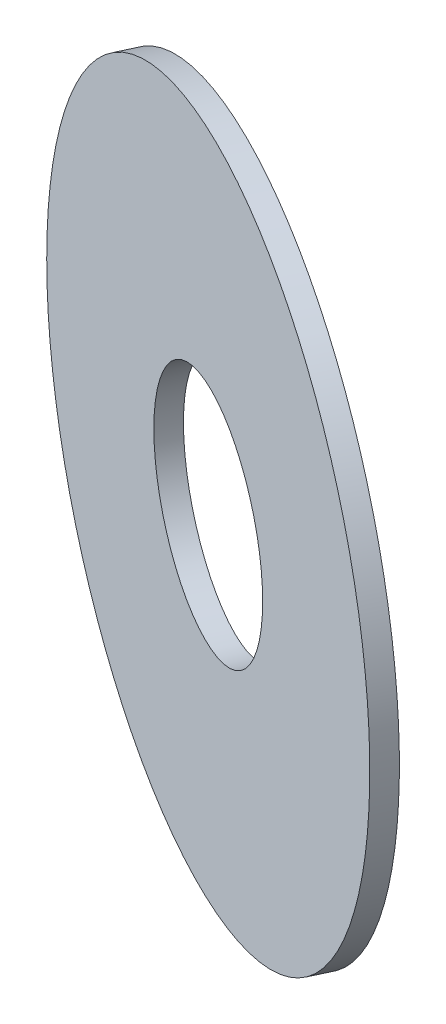
ISO-10303-21;
HEADER;
FILE_DESCRIPTION(('STEP AP214'),'2;1');
FILE_NAME('part.step','',(''),(''),'','','');
FILE_SCHEMA(('AUTOMOTIVE_DESIGN { 1 0 10303 214 1 1 1 1 }'));
ENDSEC;
DATA;
#1=APPLICATION_CONTEXT('core data for automotive mechanical design processes');
#2=APPLICATION_PROTOCOL_DEFINITION('international standard','automotive_design',2000,#1);
#3=PRODUCT_CONTEXT('',#1,'mechanical');
#4=PRODUCT('Part','Part','',(#3));
#5=PRODUCT_RELATED_PRODUCT_CATEGORY('part','',(#4));
#6=PRODUCT_DEFINITION_FORMATION('','',#4);
#7=PRODUCT_DEFINITION_CONTEXT('part definition',#1,'design');
#8=PRODUCT_DEFINITION('design','',#6,#7);
#9=PRODUCT_DEFINITION_SHAPE('','',#8);
#10=(LENGTH_UNIT() NAMED_UNIT(*) SI_UNIT(.MILLI.,.METRE.));
#11=(NAMED_UNIT(*) PLANE_ANGLE_UNIT() SI_UNIT($,.RADIAN.));
#12=(NAMED_UNIT(*) SI_UNIT($,.STERADIAN.) SOLID_ANGLE_UNIT());
#13=UNCERTAINTY_MEASURE_WITH_UNIT(LENGTH_MEASURE(1.E-05),#10,'distance_accuracy_value','');
#14=(GEOMETRIC_REPRESENTATION_CONTEXT(3) GLOBAL_UNCERTAINTY_ASSIGNED_CONTEXT((#13)) GLOBAL_UNIT_ASSIGNED_CONTEXT((#10,
#11,#12)) REPRESENTATION_CONTEXT('',''));
#15=CARTESIAN_POINT('',(0.,0.,0.));
#16=DIRECTION('',(0.,0.,1.));
#17=DIRECTION('',(1.,0.,0.));
#18=AXIS2_PLACEMENT_3D('',#15,#16,#17);
#19=CARTESIAN_POINT('',(349.082684197818,469.,-748.610232092273));
#20=DIRECTION('',(0.4226182617407,0.,-0.90630778703665));
#21=DIRECTION('',(-0.90630778703665,0.,-0.4226182617407));
#22=AXIS2_PLACEMENT_3D('',#19,#20,#21);
#23=PLANE('',#22);
#24=CARTESIAN_POINT('',(349.082684197818,469.,-748.610232092273));
#25=DIRECTION('',(0.4226182617407,0.,-0.90630778703665));
#26=DIRECTION('',(-0.90630778703665,0.,-0.4226182617407));
#27=AXIS2_PLACEMENT_3D('',#24,#25,#26);
#28=CIRCLE('',#27,30.0000000000001);
#29=CARTESIAN_POINT('',(321.893450586719,469.,-761.288779944494));
#30=VERTEX_POINT('',#29);
#31=EDGE_CURVE('E10',#30,#30,#28,.T.);
#32=ORIENTED_EDGE('',*,*,#31,.T.);
#33=EDGE_LOOP('',(#32));
#34=FACE_BOUND('',#33,.T.);
#35=CARTESIAN_POINT('',(349.082684197818,469.,-748.610232092273));
#36=DIRECTION('',(0.4226182617407,0.,-0.90630778703665));
#37=DIRECTION('',(-0.90630778703665,0.,-0.4226182617407));
#38=AXIS2_PLACEMENT_3D('',#35,#36,#37);
#39=CIRCLE('',#38,10.1);
#40=CARTESIAN_POINT('',(339.928975548748,469.,-752.878676535854));
#41=VERTEX_POINT('',#40);
#42=EDGE_CURVE('E52',#41,#41,#39,.T.);
#43=ORIENTED_EDGE('',*,*,#42,.F.);
#44=EDGE_LOOP('',(#43));
#45=FACE_BOUND('',#44,.T.);
#46=ADVANCED_FACE('F38',(#34,#45),#23,.T.);
#47=CARTESIAN_POINT('',(348.237447674337,469.,-746.797616518199));
#48=DIRECTION('',(0.4226182617407,0.,-0.90630778703665));
#49=DIRECTION('',(-0.90630778703665,0.,-0.4226182617407));
#50=AXIS2_PLACEMENT_3D('',#47,#48,#49);
#51=PLANE('',#50);
#52=CARTESIAN_POINT('',(348.237447674337,469.,-746.797616518199));
#53=DIRECTION('',(0.4226182617407,0.,-0.90630778703665));
#54=DIRECTION('',(-0.90630778703665,0.,-0.4226182617407));
#55=AXIS2_PLACEMENT_3D('',#52,#53,#54);
#56=CIRCLE('',#55,30.0000000000001);
#57=CARTESIAN_POINT('',(321.048214063237,469.,-759.47616437042));
#58=VERTEX_POINT('',#57);
#59=EDGE_CURVE('E42',#58,#58,#56,.T.);
#60=ORIENTED_EDGE('',*,*,#59,.F.);
#61=EDGE_LOOP('',(#60));
#62=FACE_BOUND('',#61,.T.);
#63=CARTESIAN_POINT('',(348.237447674337,469.,-746.797616518199));
#64=DIRECTION('',(0.4226182617407,0.,-0.90630778703665));
#65=DIRECTION('',(-0.90630778703665,0.,-0.4226182617407));
#66=AXIS2_PLACEMENT_3D('',#63,#64,#65);
#67=CIRCLE('',#66,10.1);
#68=CARTESIAN_POINT('',(339.083739025267,469.,-751.06606096178));
#69=VERTEX_POINT('',#68);
#70=EDGE_CURVE('E54',#69,#69,#67,.T.);
#71=ORIENTED_EDGE('',*,*,#70,.T.);
#72=EDGE_LOOP('',(#71));
#73=FACE_BOUND('',#72,.T.);
#74=ADVANCED_FACE('F67',(#62,#73),#51,.F.);
#75=CARTESIAN_POINT('',(349.082684197818,469.,-748.610232092273));
#76=DIRECTION('',(-0.4226182617407,0.,0.90630778703665));
#77=DIRECTION('',(0.90630778703665,0.,0.4226182617407));
#78=AXIS2_PLACEMENT_3D('',#75,#76,#77);
#79=CYLINDRICAL_SURFACE('',#78,30.0000000000001);
#80=ORIENTED_EDGE('',*,*,#31,.F.);
#81=EDGE_LOOP('',(#80));
#82=FACE_BOUND('',#81,.T.);
#83=ORIENTED_EDGE('',*,*,#59,.T.);
#84=EDGE_LOOP('',(#83));
#85=FACE_BOUND('',#84,.T.);
#86=ADVANCED_FACE('F40',(#82,#85),#79,.T.);
#87=CARTESIAN_POINT('',(349.082684197818,469.,-748.610232092273));
#88=DIRECTION('',(-0.4226182617407,0.,0.90630778703665));
#89=DIRECTION('',(0.90630778703665,0.,0.4226182617407));
#90=AXIS2_PLACEMENT_3D('',#87,#88,#89);
#91=CYLINDRICAL_SURFACE('',#90,10.1);
#92=ORIENTED_EDGE('',*,*,#42,.T.);
#93=EDGE_LOOP('',(#92));
#94=FACE_BOUND('',#93,.T.);
#95=ORIENTED_EDGE('',*,*,#70,.F.);
#96=EDGE_LOOP('',(#95));
#97=FACE_BOUND('',#96,.T.);
#98=ADVANCED_FACE('F63',(#94,#97),#91,.F.);
#99=CLOSED_SHELL('',(#46,#74,#86,#98));
#100=MANIFOLD_SOLID_BREP('B2',#99);
#101=ADVANCED_BREP_SHAPE_REPRESENTATION('',(#18,#100),#14);
#102=SHAPE_DEFINITION_REPRESENTATION(#9,#101);
ENDSEC;
END-ISO-10303-21;
